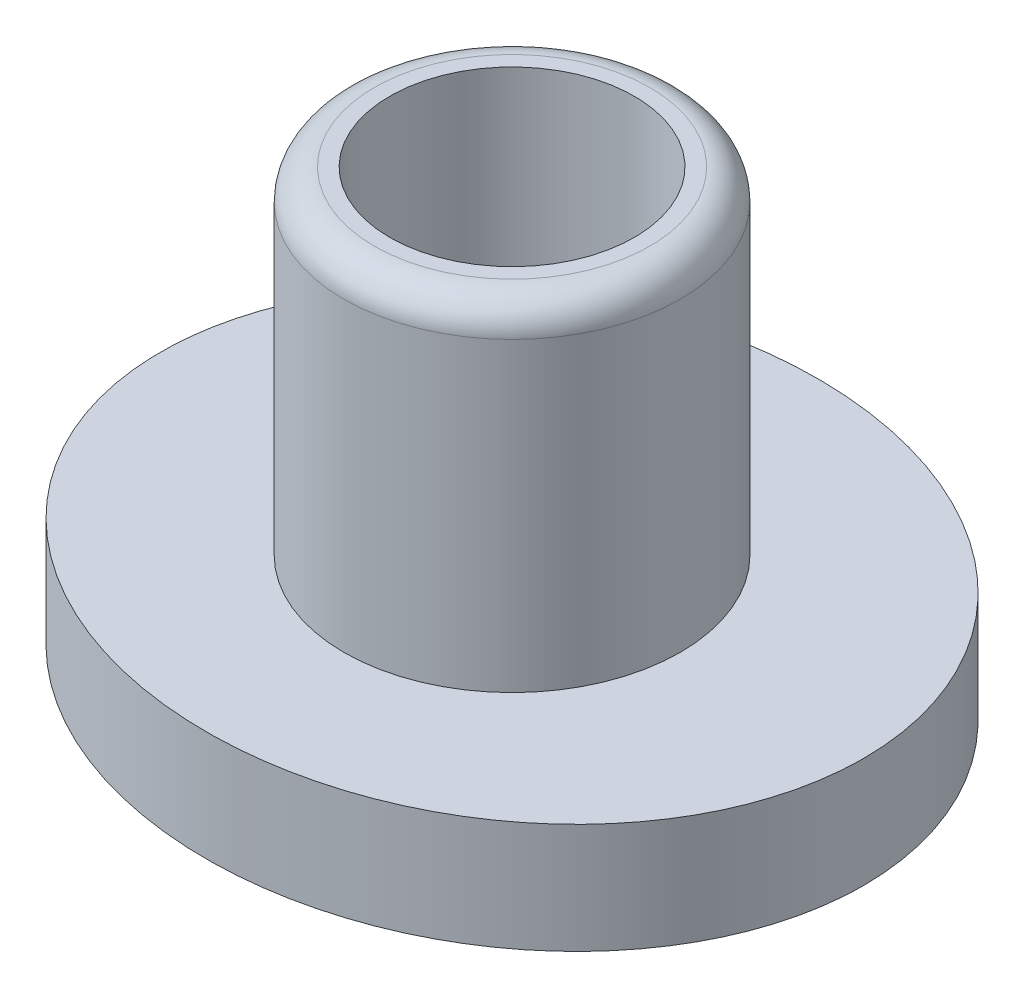
ISO-10303-21;
HEADER;
FILE_DESCRIPTION(('STEP AP214'),'2;1');
FILE_NAME('part.step','',(''),(''),'','','');
FILE_SCHEMA(('AUTOMOTIVE_DESIGN { 1 0 10303 214 1 1 1 1 }'));
ENDSEC;
DATA;
#1=APPLICATION_CONTEXT('core data for automotive mechanical design processes');
#2=APPLICATION_PROTOCOL_DEFINITION('international standard','automotive_design',2000,#1);
#3=PRODUCT_CONTEXT('',#1,'mechanical');
#4=PRODUCT('Part','Part','',(#3));
#5=PRODUCT_RELATED_PRODUCT_CATEGORY('part','',(#4));
#6=PRODUCT_DEFINITION_FORMATION('','',#4);
#7=PRODUCT_DEFINITION_CONTEXT('part definition',#1,'design');
#8=PRODUCT_DEFINITION('design','',#6,#7);
#9=PRODUCT_DEFINITION_SHAPE('','',#8);
#10=(LENGTH_UNIT() NAMED_UNIT(*) SI_UNIT(.MILLI.,.METRE.));
#11=(NAMED_UNIT(*) PLANE_ANGLE_UNIT() SI_UNIT($,.RADIAN.));
#12=(NAMED_UNIT(*) SI_UNIT($,.STERADIAN.) SOLID_ANGLE_UNIT());
#13=UNCERTAINTY_MEASURE_WITH_UNIT(LENGTH_MEASURE(1.E-05),#10,'distance_accuracy_value','');
#14=(GEOMETRIC_REPRESENTATION_CONTEXT(3) GLOBAL_UNCERTAINTY_ASSIGNED_CONTEXT((#13)) GLOBAL_UNIT_ASSIGNED_CONTEXT((#10,
#11,#12)) REPRESENTATION_CONTEXT('',''));
#15=CARTESIAN_POINT('',(0.,0.,0.));
#16=DIRECTION('',(0.,0.,1.));
#17=DIRECTION('',(1.,0.,0.));
#18=AXIS2_PLACEMENT_3D('',#15,#16,#17);
#19=CARTESIAN_POINT('',(0.,1.8,0.));
#20=DIRECTION('',(0.,1.,0.));
#21=DIRECTION('',(0.,0.,1.));
#22=AXIS2_PLACEMENT_3D('',#19,#20,#21);
#23=PLANE('',#22);
#24=CARTESIAN_POINT('',(0.,1.8,0.));
#25=DIRECTION('',(0.,1.,0.));
#26=DIRECTION('',(1.,0.,0.));
#27=AXIS2_PLACEMENT_3D('',#24,#25,#26);
#28=ELLIPSE('',#27,5.75,5.);
#29=CARTESIAN_POINT('',(5.75,1.8,0.));
#30=VERTEX_POINT('',#29);
#31=EDGE_CURVE('E50',#30,#30,#28,.T.);
#32=ORIENTED_EDGE('',*,*,#31,.T.);
#33=EDGE_LOOP('',(#32));
#34=FACE_BOUND('',#33,.T.);
#35=CARTESIAN_POINT('',(0.,1.8,0.));
#36=DIRECTION('',(0.,1.,0.));
#37=DIRECTION('',(0.,0.,1.));
#38=AXIS2_PLACEMENT_3D('',#35,#36,#37);
#39=CIRCLE('',#38,2.75);
#40=CARTESIAN_POINT('',(0.,1.8,2.75));
#41=VERTEX_POINT('',#40);
#42=EDGE_CURVE('E54',#41,#41,#39,.T.);
#43=ORIENTED_EDGE('',*,*,#42,.F.);
#44=EDGE_LOOP('',(#43));
#45=FACE_BOUND('',#44,.T.);
#46=ADVANCED_FACE('F30',(#34,#45),#23,.T.);
#47=DIRECTION('',(0.,-1.,0.));
#48=VECTOR('',#47,1.);
#49=SURFACE_OF_LINEAR_EXTRUSION('',#28,#48);
#50=ORIENTED_EDGE('',*,*,#31,.F.);
#51=EDGE_LOOP('',(#50));
#52=FACE_BOUND('',#51,.T.);
#53=CARTESIAN_POINT('',(0.,0.,0.));
#54=DIRECTION('',(0.,1.,0.));
#55=DIRECTION('',(1.,0.,0.));
#56=AXIS2_PLACEMENT_3D('',#53,#54,#55);
#57=ELLIPSE('',#56,5.75,5.);
#58=CARTESIAN_POINT('',(5.75,0.,0.));
#59=VERTEX_POINT('',#58);
#60=EDGE_CURVE('E51',#59,#59,#57,.T.);
#61=ORIENTED_EDGE('',*,*,#60,.T.);
#62=EDGE_LOOP('',(#61));
#63=FACE_BOUND('',#62,.T.);
#64=ADVANCED_FACE('F60',(#52,#63),#49,.F.);
#65=CARTESIAN_POINT('',(0.,0.,0.));
#66=DIRECTION('',(0.,1.,0.));
#67=DIRECTION('',(0.,0.,1.));
#68=AXIS2_PLACEMENT_3D('',#65,#66,#67);
#69=PLANE('',#68);
#70=CARTESIAN_POINT('',(0.,0.,0.));
#71=DIRECTION('',(0.,1.,0.));
#72=DIRECTION('',(0.,0.,1.));
#73=AXIS2_PLACEMENT_3D('',#70,#71,#72);
#74=CIRCLE('',#73,2.25);
#75=CARTESIAN_POINT('',(0.,0.,2.25));
#76=VERTEX_POINT('',#75);
#77=EDGE_CURVE('E45',#76,#76,#74,.T.);
#78=ORIENTED_EDGE('',*,*,#77,.T.);
#79=EDGE_LOOP('',(#78));
#80=FACE_BOUND('',#79,.T.);
#81=ORIENTED_EDGE('',*,*,#60,.F.);
#82=EDGE_LOOP('',(#81));
#83=FACE_BOUND('',#82,.T.);
#84=ADVANCED_FACE('F63',(#80,#83),#69,.F.);
#85=CARTESIAN_POINT('',(0.,7.3,0.));
#86=DIRECTION('',(0.,-1.,0.));
#87=DIRECTION('',(0.,0.,-1.));
#88=AXIS2_PLACEMENT_3D('',#85,#86,#87);
#89=CYLINDRICAL_SURFACE('',#88,2.75);
#90=CARTESIAN_POINT('',(0.,6.8,0.));
#91=DIRECTION('',(0.,1.,0.));
#92=DIRECTION('',(0.,0.,1.));
#93=AXIS2_PLACEMENT_3D('',#90,#91,#92);
#94=CIRCLE('',#93,2.75);
#95=CARTESIAN_POINT('',(0.,6.8,2.75));
#96=VERTEX_POINT('',#95);
#97=EDGE_CURVE('E10',#96,#96,#94,.F.);
#98=ORIENTED_EDGE('',*,*,#97,.T.);
#99=EDGE_LOOP('',(#98));
#100=FACE_BOUND('',#99,.T.);
#101=ORIENTED_EDGE('',*,*,#42,.T.);
#102=EDGE_LOOP('',(#101));
#103=FACE_BOUND('',#102,.T.);
#104=ADVANCED_FACE('F86',(#100,#103),#89,.T.);
#105=CARTESIAN_POINT('',(0.,7.3,0.));
#106=DIRECTION('',(0.,1.,0.));
#107=DIRECTION('',(0.,0.,1.));
#108=AXIS2_PLACEMENT_3D('',#105,#106,#107);
#109=PLANE('',#108);
#110=CARTESIAN_POINT('',(0.,7.3,0.));
#111=DIRECTION('',(0.,1.,0.));
#112=DIRECTION('',(0.,0.,1.));
#113=AXIS2_PLACEMENT_3D('',#110,#111,#112);
#114=CIRCLE('',#113,2.25);
#115=CARTESIAN_POINT('',(0.,7.3,2.25));
#116=VERTEX_POINT('',#115);
#117=EDGE_CURVE('E37',#116,#116,#114,.T.);
#118=ORIENTED_EDGE('',*,*,#117,.T.);
#119=EDGE_LOOP('',(#118));
#120=FACE_BOUND('',#119,.T.);
#121=CARTESIAN_POINT('',(0.,7.3,0.));
#122=DIRECTION('',(0.,1.,0.));
#123=DIRECTION('',(0.,0.,1.));
#124=AXIS2_PLACEMENT_3D('',#121,#122,#123);
#125=CIRCLE('',#124,2.);
#126=CARTESIAN_POINT('',(0.,7.3,2.));
#127=VERTEX_POINT('',#126);
#128=EDGE_CURVE('E95',#127,#127,#125,.T.);
#129=ORIENTED_EDGE('',*,*,#128,.F.);
#130=EDGE_LOOP('',(#129));
#131=FACE_BOUND('',#130,.T.);
#132=ADVANCED_FACE('F75',(#120,#131),#109,.T.);
#133=CARTESIAN_POINT('',(0.,0.,0.));
#134=DIRECTION('',(0.,1.,0.));
#135=DIRECTION('',(0.,0.,1.));
#136=AXIS2_PLACEMENT_3D('',#133,#134,#135);
#137=CYLINDRICAL_SURFACE('',#136,2.);
#138=CARTESIAN_POINT('',(0.,0.25,0.));
#139=DIRECTION('',(0.,1.,0.));
#140=DIRECTION('',(0.,0.,1.));
#141=AXIS2_PLACEMENT_3D('',#138,#139,#140);
#142=CIRCLE('',#141,2.);
#143=CARTESIAN_POINT('',(0.,0.25,2.));
#144=VERTEX_POINT('',#143);
#145=EDGE_CURVE('E41',#144,#144,#142,.F.);
#146=ORIENTED_EDGE('',*,*,#145,.T.);
#147=EDGE_LOOP('',(#146));
#148=FACE_BOUND('',#147,.T.);
#149=ORIENTED_EDGE('',*,*,#128,.T.);
#150=EDGE_LOOP('',(#149));
#151=FACE_BOUND('',#150,.T.);
#152=ADVANCED_FACE('F68',(#148,#151),#137,.F.);
#153=CARTESIAN_POINT('',(0.,0.25,0.));
#154=DIRECTION('',(0.,1.,0.));
#155=DIRECTION('',(0.,0.,1.));
#156=AXIS2_PLACEMENT_3D('',#153,#154,#155);
#157=TOROIDAL_SURFACE('',#156,2.25,0.25);
#158=ORIENTED_EDGE('',*,*,#145,.F.);
#159=EDGE_LOOP('',(#158));
#160=FACE_BOUND('',#159,.T.);
#161=ORIENTED_EDGE('',*,*,#77,.F.);
#162=EDGE_LOOP('',(#161));
#163=FACE_BOUND('',#162,.T.);
#164=ADVANCED_FACE('F66',(#160,#163),#157,.T.);
#165=CARTESIAN_POINT('',(0.,6.8,0.));
#166=DIRECTION('',(0.,1.,0.));
#167=DIRECTION('',(0.,0.,1.));
#168=AXIS2_PLACEMENT_3D('',#165,#166,#167);
#169=TOROIDAL_SURFACE('',#168,2.25,0.5);
#170=ORIENTED_EDGE('',*,*,#97,.F.);
#171=EDGE_LOOP('',(#170));
#172=FACE_BOUND('',#171,.T.);
#173=ORIENTED_EDGE('',*,*,#117,.F.);
#174=EDGE_LOOP('',(#173));
#175=FACE_BOUND('',#174,.T.);
#176=ADVANCED_FACE('F32',(#172,#175),#169,.T.);
#177=CLOSED_SHELL('',(#46,#64,#84,#104,#132,#152,#164,#176));
#178=MANIFOLD_SOLID_BREP('B2',#177);
#179=ADVANCED_BREP_SHAPE_REPRESENTATION('',(#18,#178),#14);
#180=SHAPE_DEFINITION_REPRESENTATION(#9,#179);
ENDSEC;
END-ISO-10303-21;
